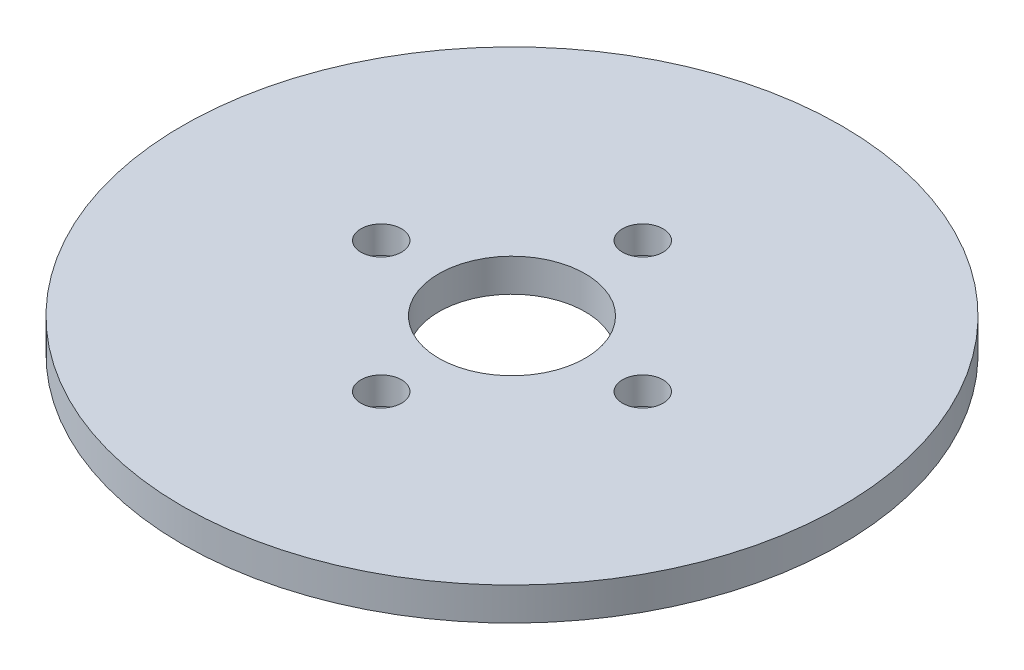
ISO-10303-21;
HEADER;
FILE_DESCRIPTION(('STEP AP214'),'2;1');
FILE_NAME('part.step','',(''),(''),'','','');
FILE_SCHEMA(('AUTOMOTIVE_DESIGN { 1 0 10303 214 1 1 1 1 }'));
ENDSEC;
DATA;
#1=APPLICATION_CONTEXT('core data for automotive mechanical design processes');
#2=APPLICATION_PROTOCOL_DEFINITION('international standard','automotive_design',2000,#1);
#3=PRODUCT_CONTEXT('',#1,'mechanical');
#4=PRODUCT('Part','Part','',(#3));
#5=PRODUCT_RELATED_PRODUCT_CATEGORY('part','',(#4));
#6=PRODUCT_DEFINITION_FORMATION('','',#4);
#7=PRODUCT_DEFINITION_CONTEXT('part definition',#1,'design');
#8=PRODUCT_DEFINITION('design','',#6,#7);
#9=PRODUCT_DEFINITION_SHAPE('','',#8);
#10=(LENGTH_UNIT() NAMED_UNIT(*) SI_UNIT(.MILLI.,.METRE.));
#11=(NAMED_UNIT(*) PLANE_ANGLE_UNIT() SI_UNIT($,.RADIAN.));
#12=(NAMED_UNIT(*) SI_UNIT($,.STERADIAN.) SOLID_ANGLE_UNIT());
#13=UNCERTAINTY_MEASURE_WITH_UNIT(LENGTH_MEASURE(1.E-05),#10,'distance_accuracy_value','');
#14=(GEOMETRIC_REPRESENTATION_CONTEXT(3) GLOBAL_UNCERTAINTY_ASSIGNED_CONTEXT((#13)) GLOBAL_UNIT_ASSIGNED_CONTEXT((#10,
#11,#12)) REPRESENTATION_CONTEXT('',''));
#15=CARTESIAN_POINT('',(0.,0.,0.));
#16=DIRECTION('',(0.,0.,1.));
#17=DIRECTION('',(1.,0.,0.));
#18=AXIS2_PLACEMENT_3D('',#15,#16,#17);
#19=CARTESIAN_POINT('',(0.,9.,0.));
#20=DIRECTION('',(0.,-1.,0.));
#21=DIRECTION('',(0.,0.,-1.));
#22=AXIS2_PLACEMENT_3D('',#19,#20,#21);
#23=CYLINDRICAL_SURFACE('',#22,90.);
#24=CARTESIAN_POINT('',(0.,9.,0.));
#25=DIRECTION('',(0.,1.,0.));
#26=DIRECTION('',(0.,0.,1.));
#27=AXIS2_PLACEMENT_3D('',#24,#25,#26);
#28=CIRCLE('',#27,90.);
#29=CARTESIAN_POINT('',(0.,9.,90.));
#30=VERTEX_POINT('',#29);
#31=EDGE_CURVE('E10',#30,#30,#28,.T.);
#32=ORIENTED_EDGE('',*,*,#31,.F.);
#33=EDGE_LOOP('',(#32));
#34=FACE_BOUND('',#33,.T.);
#35=CARTESIAN_POINT('',(0.,0.,0.));
#36=DIRECTION('',(0.,1.,0.));
#37=DIRECTION('',(0.,0.,1.));
#38=AXIS2_PLACEMENT_3D('',#35,#36,#37);
#39=CIRCLE('',#38,90.);
#40=CARTESIAN_POINT('',(0.,0.,90.));
#41=VERTEX_POINT('',#40);
#42=EDGE_CURVE('E37',#41,#41,#39,.T.);
#43=ORIENTED_EDGE('',*,*,#42,.T.);
#44=EDGE_LOOP('',(#43));
#45=FACE_BOUND('',#44,.T.);
#46=ADVANCED_FACE('F40',(#34,#45),#23,.T.);
#47=CARTESIAN_POINT('',(0.,9.,0.));
#48=DIRECTION('',(0.,1.,0.));
#49=DIRECTION('',(0.,0.,1.));
#50=AXIS2_PLACEMENT_3D('',#47,#48,#49);
#51=PLANE('',#50);
#52=CARTESIAN_POINT('',(1.24696606542535E-13,9.,35.7145275717992));
#53=DIRECTION('',(0.,1.,0.));
#54=DIRECTION('',(1.,0.,0.));
#55=AXIS2_PLACEMENT_3D('',#52,#53,#54);
#56=CIRCLE('',#55,5.55122733990672);
#57=CARTESIAN_POINT('',(5.55122733990684,9.,35.7145275717991));
#58=VERTEX_POINT('',#57);
#59=EDGE_CURVE('E71',#58,#58,#56,.T.);
#60=ORIENTED_EDGE('',*,*,#59,.F.);
#61=EDGE_LOOP('',(#60));
#62=FACE_BOUND('',#61,.T.);
#63=CARTESIAN_POINT('',(35.7145275717992,9.,0.));
#64=DIRECTION('',(0.,1.,0.));
#65=DIRECTION('',(0.,0.,-1.));
#66=AXIS2_PLACEMENT_3D('',#63,#64,#65);
#67=CIRCLE('',#66,5.55122733990672);
#68=CARTESIAN_POINT('',(35.7145275717992,9.,-5.55122733990672));
#69=VERTEX_POINT('',#68);
#70=EDGE_CURVE('E70',#69,#69,#67,.T.);
#71=ORIENTED_EDGE('',*,*,#70,.F.);
#72=EDGE_LOOP('',(#71));
#73=FACE_BOUND('',#72,.T.);
#74=CARTESIAN_POINT('',(-3.74089819627606E-13,9.,-35.7145275717992));
#75=DIRECTION('',(0.,1.,0.));
#76=DIRECTION('',(-1.,0.,0.));
#77=AXIS2_PLACEMENT_3D('',#74,#75,#76);
#78=CIRCLE('',#77,5.55122733990672);
#79=CARTESIAN_POINT('',(-5.55122733990709,9.,-35.7145275717991));
#80=VERTEX_POINT('',#79);
#81=EDGE_CURVE('E61',#80,#80,#78,.T.);
#82=ORIENTED_EDGE('',*,*,#81,.F.);
#83=EDGE_LOOP('',(#82));
#84=FACE_BOUND('',#83,.T.);
#85=CARTESIAN_POINT('',(-35.7145275717992,9.,0.));
#86=DIRECTION('',(0.,1.,0.));
#87=DIRECTION('',(0.,0.,1.));
#88=AXIS2_PLACEMENT_3D('',#85,#86,#87);
#89=CIRCLE('',#88,5.55122733990672);
#90=CARTESIAN_POINT('',(-35.7145275717992,9.,5.55122733990672));
#91=VERTEX_POINT('',#90);
#92=EDGE_CURVE('E54',#91,#91,#89,.T.);
#93=ORIENTED_EDGE('',*,*,#92,.F.);
#94=EDGE_LOOP('',(#93));
#95=FACE_BOUND('',#94,.T.);
#96=CARTESIAN_POINT('',(0.,9.,0.));
#97=DIRECTION('',(0.,1.,0.));
#98=DIRECTION('',(0.,0.,1.));
#99=AXIS2_PLACEMENT_3D('',#96,#97,#98);
#100=CIRCLE('',#99,20.);
#101=CARTESIAN_POINT('',(0.,9.,20.));
#102=VERTEX_POINT('',#101);
#103=EDGE_CURVE('E50',#102,#102,#100,.T.);
#104=ORIENTED_EDGE('',*,*,#103,.F.);
#105=EDGE_LOOP('',(#104));
#106=FACE_BOUND('',#105,.T.);
#107=ORIENTED_EDGE('',*,*,#31,.T.);
#108=EDGE_LOOP('',(#107));
#109=FACE_BOUND('',#108,.T.);
#110=ADVANCED_FACE('F86',(#62,#73,#84,#95,#106,#109),#51,.T.);
#111=CARTESIAN_POINT('',(0.,0.,0.));
#112=DIRECTION('',(0.,1.,0.));
#113=DIRECTION('',(0.,0.,1.));
#114=AXIS2_PLACEMENT_3D('',#111,#112,#113);
#115=PLANE('',#114);
#116=CARTESIAN_POINT('',(0.,0.,0.));
#117=DIRECTION('',(0.,1.,0.));
#118=DIRECTION('',(0.,0.,1.));
#119=AXIS2_PLACEMENT_3D('',#116,#117,#118);
#120=CIRCLE('',#119,20.);
#121=CARTESIAN_POINT('',(0.,0.,20.));
#122=VERTEX_POINT('',#121);
#123=EDGE_CURVE('E47',#122,#122,#120,.T.);
#124=ORIENTED_EDGE('',*,*,#123,.T.);
#125=EDGE_LOOP('',(#124));
#126=FACE_BOUND('',#125,.T.);
#127=ORIENTED_EDGE('',*,*,#42,.F.);
#128=EDGE_LOOP('',(#127));
#129=FACE_BOUND('',#128,.T.);
#130=ADVANCED_FACE('F93',(#126,#129),#115,.F.);
#131=CARTESIAN_POINT('',(0.,9.,0.));
#132=DIRECTION('',(0.,-1.,0.));
#133=DIRECTION('',(0.,0.,-1.));
#134=AXIS2_PLACEMENT_3D('',#131,#132,#133);
#135=CYLINDRICAL_SURFACE('',#134,20.);
#136=ORIENTED_EDGE('',*,*,#103,.T.);
#137=EDGE_LOOP('',(#136));
#138=FACE_BOUND('',#137,.T.);
#139=ORIENTED_EDGE('',*,*,#123,.F.);
#140=EDGE_LOOP('',(#139));
#141=FACE_BOUND('',#140,.T.);
#142=ADVANCED_FACE('F101',(#138,#141),#135,.F.);
#143=CARTESIAN_POINT('',(-35.7145275717992,1.53234140208016,0.));
#144=DIRECTION('',(0.,1.,0.));
#145=DIRECTION('',(0.,0.,1.));
#146=AXIS2_PLACEMENT_3D('',#143,#144,#145);
#147=CYLINDRICAL_SURFACE('',#146,5.55122733990672);
#148=CARTESIAN_POINT('',(-35.7145275717992,1.53234140208016,0.));
#149=DIRECTION('',(0.,1.,0.));
#150=DIRECTION('',(0.,0.,1.));
#151=AXIS2_PLACEMENT_3D('',#148,#149,#150);
#152=CIRCLE('',#151,5.55122733990672);
#153=CARTESIAN_POINT('',(-35.7145275717992,1.53234140208016,5.55122733990672));
#154=VERTEX_POINT('',#153);
#155=EDGE_CURVE('E55',#154,#154,#152,.T.);
#156=ORIENTED_EDGE('',*,*,#155,.F.);
#157=EDGE_LOOP('',(#156));
#158=FACE_BOUND('',#157,.T.);
#159=ORIENTED_EDGE('',*,*,#92,.T.);
#160=EDGE_LOOP('',(#159));
#161=FACE_BOUND('',#160,.T.);
#162=ADVANCED_FACE('F102',(#158,#161),#147,.F.);
#163=CARTESIAN_POINT('',(-35.7145275717992,1.53234140208016,0.));
#164=DIRECTION('',(0.,1.,0.));
#165=DIRECTION('',(0.,0.,1.));
#166=AXIS2_PLACEMENT_3D('',#163,#164,#165);
#167=PLANE('',#166);
#168=ORIENTED_EDGE('',*,*,#155,.T.);
#169=EDGE_LOOP('',(#168));
#170=FACE_BOUND('',#169,.T.);
#171=ADVANCED_FACE('F133',(#170),#167,.T.);
#172=CARTESIAN_POINT('',(-3.74089819627606E-13,1.53234140208016,-35.7145275717992));
#173=DIRECTION('',(0.,1.,0.));
#174=DIRECTION('',(0.,0.,1.));
#175=AXIS2_PLACEMENT_3D('',#172,#173,#174);
#176=CYLINDRICAL_SURFACE('',#175,5.55122733990672);
#177=CARTESIAN_POINT('',(-3.74089819627606E-13,1.53234140208016,-35.7145275717992));
#178=DIRECTION('',(0.,1.,0.));
#179=DIRECTION('',(-1.,0.,0.));
#180=AXIS2_PLACEMENT_3D('',#177,#178,#179);
#181=CIRCLE('',#180,5.55122733990672);
#182=CARTESIAN_POINT('',(-5.55122733990709,1.53234140208016,-35.7145275717991));
#183=VERTEX_POINT('',#182);
#184=EDGE_CURVE('E63',#183,#183,#181,.T.);
#185=ORIENTED_EDGE('',*,*,#184,.F.);
#186=EDGE_LOOP('',(#185));
#187=FACE_BOUND('',#186,.T.);
#188=ORIENTED_EDGE('',*,*,#81,.T.);
#189=EDGE_LOOP('',(#188));
#190=FACE_BOUND('',#189,.T.);
#191=ADVANCED_FACE('F142',(#187,#190),#176,.F.);
#192=CARTESIAN_POINT('',(-3.74089819627606E-13,1.53234140208016,-35.7145275717992));
#193=DIRECTION('',(0.,1.,0.));
#194=DIRECTION('',(-1.,0.,0.));
#195=AXIS2_PLACEMENT_3D('',#192,#193,#194);
#196=PLANE('',#195);
#197=ORIENTED_EDGE('',*,*,#184,.T.);
#198=EDGE_LOOP('',(#197));
#199=FACE_BOUND('',#198,.T.);
#200=ADVANCED_FACE('F156',(#199),#196,.T.);
#201=CARTESIAN_POINT('',(35.7145275717992,1.53234140208016,0.));
#202=DIRECTION('',(0.,1.,0.));
#203=DIRECTION('',(0.,0.,1.));
#204=AXIS2_PLACEMENT_3D('',#201,#202,#203);
#205=CYLINDRICAL_SURFACE('',#204,5.55122733990672);
#206=CARTESIAN_POINT('',(35.7145275717992,1.53234140208016,0.));
#207=DIRECTION('',(0.,1.,0.));
#208=DIRECTION('',(0.,0.,-1.));
#209=AXIS2_PLACEMENT_3D('',#206,#207,#208);
#210=CIRCLE('',#209,5.55122733990672);
#211=CARTESIAN_POINT('',(35.7145275717992,1.53234140208016,-5.55122733990672));
#212=VERTEX_POINT('',#211);
#213=EDGE_CURVE('E69',#212,#212,#210,.T.);
#214=ORIENTED_EDGE('',*,*,#213,.F.);
#215=EDGE_LOOP('',(#214));
#216=FACE_BOUND('',#215,.T.);
#217=ORIENTED_EDGE('',*,*,#70,.T.);
#218=EDGE_LOOP('',(#217));
#219=FACE_BOUND('',#218,.T.);
#220=ADVANCED_FACE('F164',(#216,#219),#205,.F.);
#221=CARTESIAN_POINT('',(35.7145275717992,1.53234140208016,0.));
#222=DIRECTION('',(0.,1.,0.));
#223=DIRECTION('',(0.,0.,-1.));
#224=AXIS2_PLACEMENT_3D('',#221,#222,#223);
#225=PLANE('',#224);
#226=ORIENTED_EDGE('',*,*,#213,.T.);
#227=EDGE_LOOP('',(#226));
#228=FACE_BOUND('',#227,.T.);
#229=ADVANCED_FACE('F83',(#228),#225,.T.);
#230=CARTESIAN_POINT('',(1.24696606542535E-13,1.53234140208016,35.7145275717992));
#231=DIRECTION('',(0.,1.,0.));
#232=DIRECTION('',(0.,0.,1.));
#233=AXIS2_PLACEMENT_3D('',#230,#231,#232);
#234=CYLINDRICAL_SURFACE('',#233,5.55122733990672);
#235=CARTESIAN_POINT('',(1.24696606542535E-13,1.53234140208016,35.7145275717992));
#236=DIRECTION('',(0.,1.,0.));
#237=DIRECTION('',(1.,0.,0.));
#238=AXIS2_PLACEMENT_3D('',#235,#236,#237);
#239=CIRCLE('',#238,5.55122733990672);
#240=CARTESIAN_POINT('',(5.55122733990684,1.53234140208016,35.7145275717991));
#241=VERTEX_POINT('',#240);
#242=EDGE_CURVE('E59',#241,#241,#239,.T.);
#243=ORIENTED_EDGE('',*,*,#242,.F.);
#244=EDGE_LOOP('',(#243));
#245=FACE_BOUND('',#244,.T.);
#246=ORIENTED_EDGE('',*,*,#59,.T.);
#247=EDGE_LOOP('',(#246));
#248=FACE_BOUND('',#247,.T.);
#249=ADVANCED_FACE('F81',(#245,#248),#234,.F.);
#250=CARTESIAN_POINT('',(1.24696606542535E-13,1.53234140208016,35.7145275717992));
#251=DIRECTION('',(0.,1.,0.));
#252=DIRECTION('',(1.,0.,0.));
#253=AXIS2_PLACEMENT_3D('',#250,#251,#252);
#254=PLANE('',#253);
#255=ORIENTED_EDGE('',*,*,#242,.T.);
#256=EDGE_LOOP('',(#255));
#257=FACE_BOUND('',#256,.T.);
#258=ADVANCED_FACE('F78',(#257),#254,.T.);
#259=CLOSED_SHELL('',(#46,#110,#130,#142,#162,#171,#191,#200,#220,#229,#249,#258));
#260=MANIFOLD_SOLID_BREP('B2',#259);
#261=ADVANCED_BREP_SHAPE_REPRESENTATION('',(#18,#260),#14);
#262=SHAPE_DEFINITION_REPRESENTATION(#9,#261);
ENDSEC;
END-ISO-10303-21;
